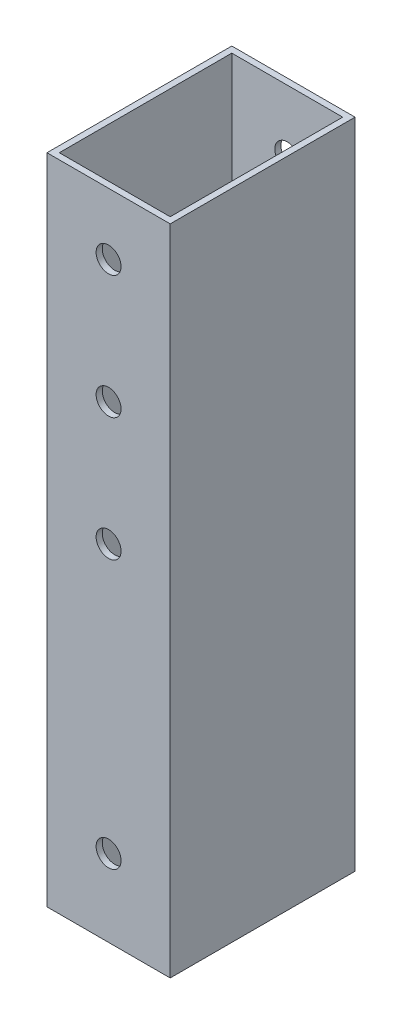
ISO-10303-21;
HEADER;
FILE_DESCRIPTION(('STEP AP214'),'2;1');
FILE_NAME('part.step','',(''),(''),'','','');
FILE_SCHEMA(('AUTOMOTIVE_DESIGN { 1 0 10303 214 1 1 1 1 }'));
ENDSEC;
DATA;
#1=APPLICATION_CONTEXT('core data for automotive mechanical design processes');
#2=APPLICATION_PROTOCOL_DEFINITION('international standard','automotive_design',2000,#1);
#3=PRODUCT_CONTEXT('',#1,'mechanical');
#4=PRODUCT('Part','Part','',(#3));
#5=PRODUCT_RELATED_PRODUCT_CATEGORY('part','',(#4));
#6=PRODUCT_DEFINITION_FORMATION('','',#4);
#7=PRODUCT_DEFINITION_CONTEXT('part definition',#1,'design');
#8=PRODUCT_DEFINITION('design','',#6,#7);
#9=PRODUCT_DEFINITION_SHAPE('','',#8);
#10=(LENGTH_UNIT() NAMED_UNIT(*) SI_UNIT(.MILLI.,.METRE.));
#11=(NAMED_UNIT(*) PLANE_ANGLE_UNIT() SI_UNIT($,.RADIAN.));
#12=(NAMED_UNIT(*) SI_UNIT($,.STERADIAN.) SOLID_ANGLE_UNIT());
#13=UNCERTAINTY_MEASURE_WITH_UNIT(LENGTH_MEASURE(1.E-05),#10,'distance_accuracy_value','');
#14=(GEOMETRIC_REPRESENTATION_CONTEXT(3) GLOBAL_UNCERTAINTY_ASSIGNED_CONTEXT((#13)) GLOBAL_UNIT_ASSIGNED_CONTEXT((#10,
#11,#12)) REPRESENTATION_CONTEXT('',''));
#15=CARTESIAN_POINT('',(0.,0.,0.));
#16=DIRECTION('',(0.,0.,1.));
#17=DIRECTION('',(1.,0.,0.));
#18=AXIS2_PLACEMENT_3D('',#15,#16,#17);
#19=CARTESIAN_POINT('',(10.,60.,15.));
#20=DIRECTION('',(-1.,0.,0.));
#21=DIRECTION('',(0.,0.,1.));
#22=AXIS2_PLACEMENT_3D('',#19,#20,#21);
#23=PLANE('',#22);
#24=DIRECTION('',(0.,-1.,0.));
#25=VECTOR('',#24,1.);
#26=CARTESIAN_POINT('',(10.,60.,15.));
#27=LINE('',#26,#25);
#28=CARTESIAN_POINT('',(10.,60.,15.));
#29=VERTEX_POINT('',#28);
#30=CARTESIAN_POINT('',(10.,-46.,15.));
#31=VERTEX_POINT('',#30);
#32=EDGE_CURVE('E113',#29,#31,#27,.T.);
#33=ORIENTED_EDGE('',*,*,#32,.T.);
#34=DIRECTION('',(0.,0.,1.));
#35=VECTOR('',#34,1.);
#36=CARTESIAN_POINT('',(10.,-46.,-15.));
#37=LINE('',#36,#35);
#38=CARTESIAN_POINT('',(10.,-46.,-15.));
#39=VERTEX_POINT('',#38);
#40=EDGE_CURVE('E51',#39,#31,#37,.T.);
#41=ORIENTED_EDGE('',*,*,#40,.F.);
#42=DIRECTION('',(0.,-1.,0.));
#43=VECTOR('',#42,1.);
#44=CARTESIAN_POINT('',(10.,60.,-15.));
#45=LINE('',#44,#43);
#46=CARTESIAN_POINT('',(10.,60.,-15.));
#47=VERTEX_POINT('',#46);
#48=EDGE_CURVE('E43',#47,#39,#45,.T.);
#49=ORIENTED_EDGE('',*,*,#48,.F.);
#50=DIRECTION('',(0.,0.,-1.));
#51=VECTOR('',#50,1.);
#52=CARTESIAN_POINT('',(10.,60.,15.));
#53=LINE('',#52,#51);
#54=EDGE_CURVE('E182',#29,#47,#53,.T.);
#55=ORIENTED_EDGE('',*,*,#54,.F.);
#56=EDGE_LOOP('',(#33,#41,#49,#55));
#57=FACE_BOUND('',#56,.T.);
#58=ADVANCED_FACE('F35',(#57),#23,.F.);
#59=CARTESIAN_POINT('',(-10.,60.,-15.));
#60=DIRECTION('',(0.,0.,1.));
#61=DIRECTION('',(1.,0.,0.));
#62=AXIS2_PLACEMENT_3D('',#59,#60,#61);
#63=PLANE('',#62);
#64=CARTESIAN_POINT('',(-5.68295410730002E-12,50.0000000000123,-15.));
#65=DIRECTION('',(0.,0.,1.));
#66=DIRECTION('',(1.,0.,0.));
#67=AXIS2_PLACEMENT_3D('',#64,#65,#66);
#68=CIRCLE('',#67,2.025);
#69=CARTESIAN_POINT('',(2.02499999999432,50.0000000000123,-15.));
#70=VERTEX_POINT('',#69);
#71=EDGE_CURVE('E131',#70,#70,#68,.T.);
#72=ORIENTED_EDGE('',*,*,#71,.T.);
#73=EDGE_LOOP('',(#72));
#74=FACE_BOUND('',#73,.T.);
#75=CARTESIAN_POINT('',(-5.14172038279526E-12,30.0000000000123,-15.));
#76=DIRECTION('',(0.,0.,1.));
#77=DIRECTION('',(1.,0.,0.));
#78=AXIS2_PLACEMENT_3D('',#75,#76,#77);
#79=CIRCLE('',#78,2.025);
#80=CARTESIAN_POINT('',(2.02499999999486,30.0000000000123,-15.));
#81=VERTEX_POINT('',#80);
#82=EDGE_CURVE('E233',#81,#81,#79,.T.);
#83=ORIENTED_EDGE('',*,*,#82,.T.);
#84=EDGE_LOOP('',(#83));
#85=FACE_BOUND('',#84,.T.);
#86=CARTESIAN_POINT('',(-5.68295410730002E-12,10.0000000000123,-15.));
#87=DIRECTION('',(0.,0.,1.));
#88=DIRECTION('',(1.,0.,0.));
#89=AXIS2_PLACEMENT_3D('',#86,#87,#88);
#90=CIRCLE('',#89,2.02500000000125);
#91=CARTESIAN_POINT('',(2.02499999999556,10.0000000000123,-15.));
#92=VERTEX_POINT('',#91);
#93=EDGE_CURVE('E237',#92,#92,#90,.T.);
#94=ORIENTED_EDGE('',*,*,#93,.T.);
#95=EDGE_LOOP('',(#94));
#96=FACE_BOUND('',#95,.T.);
#97=CARTESIAN_POINT('',(0.,-33.5,-15.));
#98=DIRECTION('',(0.,0.,1.));
#99=DIRECTION('',(1.,0.,0.));
#100=AXIS2_PLACEMENT_3D('',#97,#98,#99);
#101=CIRCLE('',#100,2.025);
#102=CARTESIAN_POINT('',(2.025,-33.5,-15.));
#103=VERTEX_POINT('',#102);
#104=EDGE_CURVE('E127',#103,#103,#101,.T.);
#105=ORIENTED_EDGE('',*,*,#104,.T.);
#106=EDGE_LOOP('',(#105));
#107=FACE_BOUND('',#106,.T.);
#108=ORIENTED_EDGE('',*,*,#48,.T.);
#109=DIRECTION('',(-1.,0.,0.));
#110=VECTOR('',#109,1.);
#111=CARTESIAN_POINT('',(-10.,-46.,-15.));
#112=LINE('',#111,#110);
#113=CARTESIAN_POINT('',(-10.,-46.,-15.));
#114=VERTEX_POINT('',#113);
#115=EDGE_CURVE('E98',#39,#114,#112,.T.);
#116=ORIENTED_EDGE('',*,*,#115,.T.);
#117=DIRECTION('',(0.,-1.,0.));
#118=VECTOR('',#117,1.);
#119=CARTESIAN_POINT('',(-10.,60.,-15.));
#120=LINE('',#119,#118);
#121=CARTESIAN_POINT('',(-10.,60.,-15.));
#122=VERTEX_POINT('',#121);
#123=EDGE_CURVE('E118',#122,#114,#120,.T.);
#124=ORIENTED_EDGE('',*,*,#123,.F.);
#125=DIRECTION('',(-1.,0.,0.));
#126=VECTOR('',#125,1.);
#127=CARTESIAN_POINT('',(-10.,60.,-15.));
#128=LINE('',#127,#126);
#129=EDGE_CURVE('E116',#47,#122,#128,.T.);
#130=ORIENTED_EDGE('',*,*,#129,.F.);
#131=EDGE_LOOP('',(#108,#116,#124,#130));
#132=FACE_BOUND('',#131,.T.);
#133=ADVANCED_FACE('F115',(#74,#85,#96,#107,#132),#63,.F.);
#134=CARTESIAN_POINT('',(-10.,60.,15.));
#135=DIRECTION('',(1.,0.,0.));
#136=DIRECTION('',(0.,0.,-1.));
#137=AXIS2_PLACEMENT_3D('',#134,#135,#136);
#138=PLANE('',#137);
#139=ORIENTED_EDGE('',*,*,#123,.T.);
#140=DIRECTION('',(0.,0.,1.));
#141=VECTOR('',#140,1.);
#142=CARTESIAN_POINT('',(-10.,-46.,-15.));
#143=LINE('',#142,#141);
#144=CARTESIAN_POINT('',(-10.,-46.,15.));
#145=VERTEX_POINT('',#144);
#146=EDGE_CURVE('E101',#114,#145,#143,.T.);
#147=ORIENTED_EDGE('',*,*,#146,.T.);
#148=DIRECTION('',(0.,-1.,0.));
#149=VECTOR('',#148,1.);
#150=CARTESIAN_POINT('',(-10.,60.,15.));
#151=LINE('',#150,#149);
#152=CARTESIAN_POINT('',(-10.,60.,15.));
#153=VERTEX_POINT('',#152);
#154=EDGE_CURVE('E120',#153,#145,#151,.T.);
#155=ORIENTED_EDGE('',*,*,#154,.F.);
#156=DIRECTION('',(0.,0.,1.));
#157=VECTOR('',#156,1.);
#158=CARTESIAN_POINT('',(-10.,60.,15.));
#159=LINE('',#158,#157);
#160=EDGE_CURVE('E190',#122,#153,#159,.T.);
#161=ORIENTED_EDGE('',*,*,#160,.F.);
#162=EDGE_LOOP('',(#139,#147,#155,#161));
#163=FACE_BOUND('',#162,.T.);
#164=ADVANCED_FACE('F201',(#163),#138,.F.);
#165=CARTESIAN_POINT('',(-10.,60.,15.));
#166=DIRECTION('',(0.,0.,-1.));
#167=DIRECTION('',(-1.,0.,0.));
#168=AXIS2_PLACEMENT_3D('',#165,#166,#167);
#169=PLANE('',#168);
#170=CARTESIAN_POINT('',(-5.68295410730002E-12,50.0000000000123,15.));
#171=DIRECTION('',(0.,0.,1.));
#172=DIRECTION('',(1.,0.,0.));
#173=AXIS2_PLACEMENT_3D('',#170,#171,#172);
#174=CIRCLE('',#173,2.025);
#175=CARTESIAN_POINT('',(2.02499999999432,50.0000000000123,15.));
#176=VERTEX_POINT('',#175);
#177=EDGE_CURVE('E314',#176,#176,#174,.T.);
#178=ORIENTED_EDGE('',*,*,#177,.F.);
#179=EDGE_LOOP('',(#178));
#180=FACE_BOUND('',#179,.T.);
#181=CARTESIAN_POINT('',(-5.14172038279526E-12,30.0000000000123,15.));
#182=DIRECTION('',(0.,0.,1.));
#183=DIRECTION('',(1.,0.,0.));
#184=AXIS2_PLACEMENT_3D('',#181,#182,#183);
#185=CIRCLE('',#184,2.025);
#186=CARTESIAN_POINT('',(2.02499999999486,30.0000000000123,15.));
#187=VERTEX_POINT('',#186);
#188=EDGE_CURVE('E308',#187,#187,#185,.T.);
#189=ORIENTED_EDGE('',*,*,#188,.F.);
#190=EDGE_LOOP('',(#189));
#191=FACE_BOUND('',#190,.T.);
#192=CARTESIAN_POINT('',(-5.68295410730002E-12,10.0000000000123,15.));
#193=DIRECTION('',(0.,0.,1.));
#194=DIRECTION('',(1.,0.,0.));
#195=AXIS2_PLACEMENT_3D('',#192,#193,#194);
#196=CIRCLE('',#195,2.02500000000125);
#197=CARTESIAN_POINT('',(2.02499999999556,10.0000000000123,15.));
#198=VERTEX_POINT('',#197);
#199=EDGE_CURVE('E144',#198,#198,#196,.T.);
#200=ORIENTED_EDGE('',*,*,#199,.F.);
#201=EDGE_LOOP('',(#200));
#202=FACE_BOUND('',#201,.T.);
#203=CARTESIAN_POINT('',(0.,-33.5,15.));
#204=DIRECTION('',(0.,0.,1.));
#205=DIRECTION('',(1.,0.,0.));
#206=AXIS2_PLACEMENT_3D('',#203,#204,#205);
#207=CIRCLE('',#206,2.025);
#208=CARTESIAN_POINT('',(2.025,-33.5,15.));
#209=VERTEX_POINT('',#208);
#210=EDGE_CURVE('E150',#209,#209,#207,.T.);
#211=ORIENTED_EDGE('',*,*,#210,.F.);
#212=EDGE_LOOP('',(#211));
#213=FACE_BOUND('',#212,.T.);
#214=ORIENTED_EDGE('',*,*,#154,.T.);
#215=DIRECTION('',(1.,0.,0.));
#216=VECTOR('',#215,1.);
#217=CARTESIAN_POINT('',(-10.,-46.,15.));
#218=LINE('',#217,#216);
#219=EDGE_CURVE('E165',#145,#31,#218,.T.);
#220=ORIENTED_EDGE('',*,*,#219,.T.);
#221=ORIENTED_EDGE('',*,*,#32,.F.);
#222=DIRECTION('',(1.,0.,0.));
#223=VECTOR('',#222,1.);
#224=CARTESIAN_POINT('',(-10.,60.,15.));
#225=LINE('',#224,#223);
#226=EDGE_CURVE('E192',#153,#29,#225,.T.);
#227=ORIENTED_EDGE('',*,*,#226,.F.);
#228=EDGE_LOOP('',(#214,#220,#221,#227));
#229=FACE_BOUND('',#228,.T.);
#230=ADVANCED_FACE('F198',(#180,#191,#202,#213,#229),#169,.F.);
#231=CARTESIAN_POINT('',(0.,60.,0.));
#232=DIRECTION('',(0.,-1.,0.));
#233=DIRECTION('',(0.,0.,-1.));
#234=AXIS2_PLACEMENT_3D('',#231,#232,#233);
#235=PLANE('',#234);
#236=DIRECTION('',(0.,0.,-1.));
#237=VECTOR('',#236,1.);
#238=CARTESIAN_POINT('',(9.,60.,14.));
#239=LINE('',#238,#237);
#240=CARTESIAN_POINT('',(9.,60.,14.));
#241=VERTEX_POINT('',#240);
#242=CARTESIAN_POINT('',(9.,60.,-14.));
#243=VERTEX_POINT('',#242);
#244=EDGE_CURVE('E170',#241,#243,#239,.T.);
#245=ORIENTED_EDGE('',*,*,#244,.F.);
#246=DIRECTION('',(1.,0.,0.));
#247=VECTOR('',#246,1.);
#248=CARTESIAN_POINT('',(-9.,60.,14.));
#249=LINE('',#248,#247);
#250=CARTESIAN_POINT('',(-9.,60.,14.));
#251=VERTEX_POINT('',#250);
#252=EDGE_CURVE('E167',#251,#241,#249,.T.);
#253=ORIENTED_EDGE('',*,*,#252,.F.);
#254=DIRECTION('',(0.,0.,1.));
#255=VECTOR('',#254,1.);
#256=CARTESIAN_POINT('',(-9.,60.,-14.));
#257=LINE('',#256,#255);
#258=CARTESIAN_POINT('',(-9.,60.,-14.));
#259=VERTEX_POINT('',#258);
#260=EDGE_CURVE('E176',#259,#251,#257,.T.);
#261=ORIENTED_EDGE('',*,*,#260,.F.);
#262=DIRECTION('',(-1.,0.,0.));
#263=VECTOR('',#262,1.);
#264=CARTESIAN_POINT('',(9.,60.,-14.));
#265=LINE('',#264,#263);
#266=EDGE_CURVE('E173',#243,#259,#265,.T.);
#267=ORIENTED_EDGE('',*,*,#266,.F.);
#268=EDGE_LOOP('',(#245,#253,#261,#267));
#269=FACE_BOUND('',#268,.T.);
#270=ORIENTED_EDGE('',*,*,#54,.T.);
#271=ORIENTED_EDGE('',*,*,#129,.T.);
#272=ORIENTED_EDGE('',*,*,#160,.T.);
#273=ORIENTED_EDGE('',*,*,#226,.T.);
#274=EDGE_LOOP('',(#270,#271,#272,#273));
#275=FACE_BOUND('',#274,.T.);
#276=ADVANCED_FACE('F203',(#269,#275),#235,.F.);
#277=CARTESIAN_POINT('',(-9.,-60.,14.));
#278=DIRECTION('',(0.,0.,1.));
#279=DIRECTION('',(1.,0.,0.));
#280=AXIS2_PLACEMENT_3D('',#277,#278,#279);
#281=PLANE('',#280);
#282=CARTESIAN_POINT('',(-5.68295410730002E-12,50.0000000000123,14.));
#283=DIRECTION('',(0.,0.,1.));
#284=DIRECTION('',(1.,0.,0.));
#285=AXIS2_PLACEMENT_3D('',#282,#283,#284);
#286=CIRCLE('',#285,2.025);
#287=CARTESIAN_POINT('',(2.02499999999432,50.0000000000123,14.));
#288=VERTEX_POINT('',#287);
#289=EDGE_CURVE('E147',#288,#288,#286,.T.);
#290=ORIENTED_EDGE('',*,*,#289,.T.);
#291=EDGE_LOOP('',(#290));
#292=FACE_BOUND('',#291,.T.);
#293=CARTESIAN_POINT('',(-5.14172038279526E-12,30.0000000000123,14.));
#294=DIRECTION('',(0.,0.,1.));
#295=DIRECTION('',(1.,0.,0.));
#296=AXIS2_PLACEMENT_3D('',#293,#294,#295);
#297=CIRCLE('',#296,2.025);
#298=CARTESIAN_POINT('',(2.02499999999486,30.0000000000123,14.));
#299=VERTEX_POINT('',#298);
#300=EDGE_CURVE('E134',#299,#299,#297,.T.);
#301=ORIENTED_EDGE('',*,*,#300,.T.);
#302=EDGE_LOOP('',(#301));
#303=FACE_BOUND('',#302,.T.);
#304=CARTESIAN_POINT('',(-5.68295410730002E-12,10.0000000000123,14.));
#305=DIRECTION('',(0.,0.,1.));
#306=DIRECTION('',(1.,0.,0.));
#307=AXIS2_PLACEMENT_3D('',#304,#305,#306);
#308=CIRCLE('',#307,2.02500000000125);
#309=CARTESIAN_POINT('',(2.02499999999556,10.0000000000123,14.));
#310=VERTEX_POINT('',#309);
#311=EDGE_CURVE('E130',#310,#310,#308,.T.);
#312=ORIENTED_EDGE('',*,*,#311,.T.);
#313=EDGE_LOOP('',(#312));
#314=FACE_BOUND('',#313,.T.);
#315=CARTESIAN_POINT('',(0.,-33.5,14.));
#316=DIRECTION('',(0.,0.,1.));
#317=DIRECTION('',(1.,0.,0.));
#318=AXIS2_PLACEMENT_3D('',#315,#316,#317);
#319=CIRCLE('',#318,2.025);
#320=CARTESIAN_POINT('',(2.025,-33.5,14.));
#321=VERTEX_POINT('',#320);
#322=EDGE_CURVE('E106',#321,#321,#319,.T.);
#323=ORIENTED_EDGE('',*,*,#322,.T.);
#324=EDGE_LOOP('',(#323));
#325=FACE_BOUND('',#324,.T.);
#326=DIRECTION('',(0.,1.,0.));
#327=VECTOR('',#326,1.);
#328=CARTESIAN_POINT('',(9.,-60.,14.));
#329=LINE('',#328,#327);
#330=CARTESIAN_POINT('',(9.,-46.,14.));
#331=VERTEX_POINT('',#330);
#332=EDGE_CURVE('E179',#331,#241,#329,.T.);
#333=ORIENTED_EDGE('',*,*,#332,.F.);
#334=DIRECTION('',(-1.,0.,0.));
#335=VECTOR('',#334,1.);
#336=CARTESIAN_POINT('',(-9.,-46.,14.));
#337=LINE('',#336,#335);
#338=CARTESIAN_POINT('',(-9.,-46.,14.));
#339=VERTEX_POINT('',#338);
#340=EDGE_CURVE('E59',#331,#339,#337,.T.);
#341=ORIENTED_EDGE('',*,*,#340,.T.);
#342=DIRECTION('',(0.,1.,0.));
#343=VECTOR('',#342,1.);
#344=CARTESIAN_POINT('',(-9.,-60.,14.));
#345=LINE('',#344,#343);
#346=EDGE_CURVE('E180',#339,#251,#345,.T.);
#347=ORIENTED_EDGE('',*,*,#346,.T.);
#348=ORIENTED_EDGE('',*,*,#252,.T.);
#349=EDGE_LOOP('',(#333,#341,#347,#348));
#350=FACE_BOUND('',#349,.T.);
#351=ADVANCED_FACE('F205',(#292,#303,#314,#325,#350),#281,.F.);
#352=CARTESIAN_POINT('',(-9.,-60.,-14.));
#353=DIRECTION('',(-1.,0.,0.));
#354=DIRECTION('',(0.,0.,1.));
#355=AXIS2_PLACEMENT_3D('',#352,#353,#354);
#356=PLANE('',#355);
#357=ORIENTED_EDGE('',*,*,#346,.F.);
#358=DIRECTION('',(0.,0.,-1.));
#359=VECTOR('',#358,1.);
#360=CARTESIAN_POINT('',(-9.,-46.,-14.));
#361=LINE('',#360,#359);
#362=CARTESIAN_POINT('',(-9.,-46.,-14.));
#363=VERTEX_POINT('',#362);
#364=EDGE_CURVE('E161',#339,#363,#361,.T.);
#365=ORIENTED_EDGE('',*,*,#364,.T.);
#366=DIRECTION('',(0.,1.,0.));
#367=VECTOR('',#366,1.);
#368=CARTESIAN_POINT('',(-9.,-60.,-14.));
#369=LINE('',#368,#367);
#370=EDGE_CURVE('E183',#363,#259,#369,.T.);
#371=ORIENTED_EDGE('',*,*,#370,.T.);
#372=ORIENTED_EDGE('',*,*,#260,.T.);
#373=EDGE_LOOP('',(#357,#365,#371,#372));
#374=FACE_BOUND('',#373,.T.);
#375=ADVANCED_FACE('F212',(#374),#356,.F.);
#376=CARTESIAN_POINT('',(9.,-60.,-14.));
#377=DIRECTION('',(0.,0.,-1.));
#378=DIRECTION('',(-1.,0.,0.));
#379=AXIS2_PLACEMENT_3D('',#376,#377,#378);
#380=PLANE('',#379);
#381=CARTESIAN_POINT('',(-5.68295410730002E-12,50.0000000000123,-14.));
#382=DIRECTION('',(0.,0.,-1.));
#383=DIRECTION('',(-1.,0.,0.));
#384=AXIS2_PLACEMENT_3D('',#381,#382,#383);
#385=CIRCLE('',#384,2.025);
#386=CARTESIAN_POINT('',(-2.02500000000568,50.0000000000123,-14.));
#387=VERTEX_POINT('',#386);
#388=EDGE_CURVE('E38',#387,#387,#385,.T.);
#389=ORIENTED_EDGE('',*,*,#388,.T.);
#390=EDGE_LOOP('',(#389));
#391=FACE_BOUND('',#390,.T.);
#392=CARTESIAN_POINT('',(-5.14172038279526E-12,30.0000000000123,-14.));
#393=DIRECTION('',(0.,0.,-1.));
#394=DIRECTION('',(-1.,0.,0.));
#395=AXIS2_PLACEMENT_3D('',#392,#393,#394);
#396=CIRCLE('',#395,2.025);
#397=CARTESIAN_POINT('',(-2.02500000000514,30.0000000000123,-14.));
#398=VERTEX_POINT('',#397);
#399=EDGE_CURVE('E132',#398,#398,#396,.T.);
#400=ORIENTED_EDGE('',*,*,#399,.T.);
#401=EDGE_LOOP('',(#400));
#402=FACE_BOUND('',#401,.T.);
#403=CARTESIAN_POINT('',(-5.68295410730002E-12,10.0000000000123,-14.));
#404=DIRECTION('',(0.,0.,-1.));
#405=DIRECTION('',(-1.,0.,0.));
#406=AXIS2_PLACEMENT_3D('',#403,#404,#405);
#407=CIRCLE('',#406,2.02500000000125);
#408=CARTESIAN_POINT('',(-2.02500000000693,10.0000000000123,-14.));
#409=VERTEX_POINT('',#408);
#410=EDGE_CURVE('E128',#409,#409,#407,.T.);
#411=ORIENTED_EDGE('',*,*,#410,.T.);
#412=EDGE_LOOP('',(#411));
#413=FACE_BOUND('',#412,.T.);
#414=CARTESIAN_POINT('',(0.,-33.5,-14.));
#415=DIRECTION('',(0.,0.,-1.));
#416=DIRECTION('',(-1.,0.,0.));
#417=AXIS2_PLACEMENT_3D('',#414,#415,#416);
#418=CIRCLE('',#417,2.025);
#419=CARTESIAN_POINT('',(-2.025,-33.5,-14.));
#420=VERTEX_POINT('',#419);
#421=EDGE_CURVE('E124',#420,#420,#418,.T.);
#422=ORIENTED_EDGE('',*,*,#421,.T.);
#423=EDGE_LOOP('',(#422));
#424=FACE_BOUND('',#423,.T.);
#425=ORIENTED_EDGE('',*,*,#370,.F.);
#426=DIRECTION('',(1.,0.,0.));
#427=VECTOR('',#426,1.);
#428=CARTESIAN_POINT('',(9.,-46.,-14.));
#429=LINE('',#428,#427);
#430=CARTESIAN_POINT('',(9.,-46.,-14.));
#431=VERTEX_POINT('',#430);
#432=EDGE_CURVE('E157',#363,#431,#429,.T.);
#433=ORIENTED_EDGE('',*,*,#432,.T.);
#434=DIRECTION('',(0.,1.,0.));
#435=VECTOR('',#434,1.);
#436=CARTESIAN_POINT('',(9.,-60.,-14.));
#437=LINE('',#436,#435);
#438=EDGE_CURVE('E185',#431,#243,#437,.T.);
#439=ORIENTED_EDGE('',*,*,#438,.T.);
#440=ORIENTED_EDGE('',*,*,#266,.T.);
#441=EDGE_LOOP('',(#425,#433,#439,#440));
#442=FACE_BOUND('',#441,.T.);
#443=ADVANCED_FACE('F247',(#391,#402,#413,#424,#442),#380,.F.);
#444=CARTESIAN_POINT('',(9.,-60.,14.));
#445=DIRECTION('',(1.,0.,0.));
#446=DIRECTION('',(0.,0.,-1.));
#447=AXIS2_PLACEMENT_3D('',#444,#445,#446);
#448=PLANE('',#447);
#449=ORIENTED_EDGE('',*,*,#438,.F.);
#450=DIRECTION('',(0.,0.,1.));
#451=VECTOR('',#450,1.);
#452=CARTESIAN_POINT('',(9.,-46.,14.));
#453=LINE('',#452,#451);
#454=EDGE_CURVE('E11',#431,#331,#453,.T.);
#455=ORIENTED_EDGE('',*,*,#454,.T.);
#456=ORIENTED_EDGE('',*,*,#332,.T.);
#457=ORIENTED_EDGE('',*,*,#244,.T.);
#458=EDGE_LOOP('',(#449,#455,#456,#457));
#459=FACE_BOUND('',#458,.T.);
#460=ADVANCED_FACE('F250',(#459),#448,.F.);
#461=CARTESIAN_POINT('',(-10.,-46.,-15.));
#462=DIRECTION('',(0.,1.,0.));
#463=DIRECTION('',(0.,0.,1.));
#464=AXIS2_PLACEMENT_3D('',#461,#462,#463);
#465=PLANE('',#464);
#466=ORIENTED_EDGE('',*,*,#454,.F.);
#467=ORIENTED_EDGE('',*,*,#432,.F.);
#468=ORIENTED_EDGE('',*,*,#364,.F.);
#469=ORIENTED_EDGE('',*,*,#340,.F.);
#470=EDGE_LOOP('',(#466,#467,#468,#469));
#471=FACE_BOUND('',#470,.T.);
#472=ORIENTED_EDGE('',*,*,#146,.F.);
#473=ORIENTED_EDGE('',*,*,#115,.F.);
#474=ORIENTED_EDGE('',*,*,#40,.T.);
#475=ORIENTED_EDGE('',*,*,#219,.F.);
#476=EDGE_LOOP('',(#472,#473,#474,#475));
#477=FACE_BOUND('',#476,.T.);
#478=ADVANCED_FACE('F99',(#471,#477),#465,.F.);
#479=CARTESIAN_POINT('',(0.,-33.5,-15.));
#480=DIRECTION('',(0.,0.,1.));
#481=DIRECTION('',(1.,0.,0.));
#482=AXIS2_PLACEMENT_3D('',#479,#480,#481);
#483=CYLINDRICAL_SURFACE('',#482,2.025);
#484=ORIENTED_EDGE('',*,*,#104,.F.);
#485=EDGE_LOOP('',(#484));
#486=FACE_BOUND('',#485,.T.);
#487=ORIENTED_EDGE('',*,*,#421,.F.);
#488=EDGE_LOOP('',(#487));
#489=FACE_BOUND('',#488,.T.);
#490=ADVANCED_FACE('F240',(#486,#489),#483,.F.);
#491=ORIENTED_EDGE('',*,*,#210,.T.);
#492=EDGE_LOOP('',(#491));
#493=FACE_BOUND('',#492,.T.);
#494=ORIENTED_EDGE('',*,*,#322,.F.);
#495=EDGE_LOOP('',(#494));
#496=FACE_BOUND('',#495,.T.);
#497=ADVANCED_FACE('F243',(#493,#496),#483,.F.);
#498=CARTESIAN_POINT('',(-5.68295410730002E-12,10.0000000000123,-15.));
#499=DIRECTION('',(0.,0.,1.));
#500=DIRECTION('',(1.,0.,0.));
#501=AXIS2_PLACEMENT_3D('',#498,#499,#500);
#502=CYLINDRICAL_SURFACE('',#501,2.02500000000125);
#503=ORIENTED_EDGE('',*,*,#93,.F.);
#504=EDGE_LOOP('',(#503));
#505=FACE_BOUND('',#504,.T.);
#506=ORIENTED_EDGE('',*,*,#410,.F.);
#507=EDGE_LOOP('',(#506));
#508=FACE_BOUND('',#507,.T.);
#509=ADVANCED_FACE('F273',(#505,#508),#502,.F.);
#510=CARTESIAN_POINT('',(-5.14172038279526E-12,30.0000000000123,-15.));
#511=DIRECTION('',(0.,0.,1.));
#512=DIRECTION('',(1.,0.,0.));
#513=AXIS2_PLACEMENT_3D('',#510,#511,#512);
#514=CYLINDRICAL_SURFACE('',#513,2.025);
#515=ORIENTED_EDGE('',*,*,#82,.F.);
#516=EDGE_LOOP('',(#515));
#517=FACE_BOUND('',#516,.T.);
#518=ORIENTED_EDGE('',*,*,#399,.F.);
#519=EDGE_LOOP('',(#518));
#520=FACE_BOUND('',#519,.T.);
#521=ADVANCED_FACE('F285',(#517,#520),#514,.F.);
#522=CARTESIAN_POINT('',(-5.68295410730002E-12,50.0000000000123,-15.));
#523=DIRECTION('',(0.,0.,1.));
#524=DIRECTION('',(1.,0.,0.));
#525=AXIS2_PLACEMENT_3D('',#522,#523,#524);
#526=CYLINDRICAL_SURFACE('',#525,2.025);
#527=ORIENTED_EDGE('',*,*,#71,.F.);
#528=EDGE_LOOP('',(#527));
#529=FACE_BOUND('',#528,.T.);
#530=ORIENTED_EDGE('',*,*,#388,.F.);
#531=EDGE_LOOP('',(#530));
#532=FACE_BOUND('',#531,.T.);
#533=ADVANCED_FACE('F279',(#529,#532),#526,.F.);
#534=ORIENTED_EDGE('',*,*,#199,.T.);
#535=EDGE_LOOP('',(#534));
#536=FACE_BOUND('',#535,.T.);
#537=ORIENTED_EDGE('',*,*,#311,.F.);
#538=EDGE_LOOP('',(#537));
#539=FACE_BOUND('',#538,.T.);
#540=ADVANCED_FACE('F275',(#536,#539),#502,.F.);
#541=ORIENTED_EDGE('',*,*,#188,.T.);
#542=EDGE_LOOP('',(#541));
#543=FACE_BOUND('',#542,.T.);
#544=ORIENTED_EDGE('',*,*,#300,.F.);
#545=EDGE_LOOP('',(#544));
#546=FACE_BOUND('',#545,.T.);
#547=ADVANCED_FACE('F278',(#543,#546),#514,.F.);
#548=ORIENTED_EDGE('',*,*,#177,.T.);
#549=EDGE_LOOP('',(#548));
#550=FACE_BOUND('',#549,.T.);
#551=ORIENTED_EDGE('',*,*,#289,.F.);
#552=EDGE_LOOP('',(#551));
#553=FACE_BOUND('',#552,.T.);
#554=ADVANCED_FACE('F283',(#550,#553),#526,.F.);
#555=CLOSED_SHELL('',(#58,#133,#164,#230,#276,#351,#375,#443,#460,#478,#490,#497,#509,#521,#533,
#540,#547,#554));
#556=MANIFOLD_SOLID_BREP('B2',#555);
#557=ADVANCED_BREP_SHAPE_REPRESENTATION('',(#18,#556),#14);
#558=SHAPE_DEFINITION_REPRESENTATION(#9,#557);
ENDSEC;
END-ISO-10303-21;
